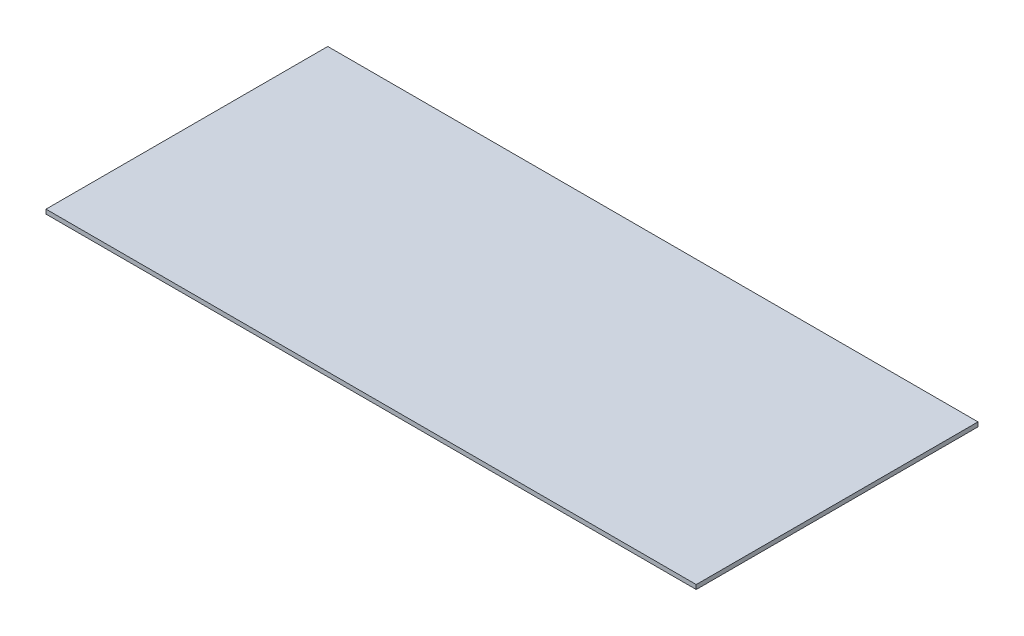
ISO-10303-21;
HEADER;
FILE_DESCRIPTION(('STEP AP214'),'2;1');
FILE_NAME('part.step','',(''),(''),'','','');
FILE_SCHEMA(('AUTOMOTIVE_DESIGN { 1 0 10303 214 1 1 1 1 }'));
ENDSEC;
DATA;
#1=APPLICATION_CONTEXT('core data for automotive mechanical design processes');
#2=APPLICATION_PROTOCOL_DEFINITION('international standard','automotive_design',2000,#1);
#3=PRODUCT_CONTEXT('',#1,'mechanical');
#4=PRODUCT('Part','Part','',(#3));
#5=PRODUCT_RELATED_PRODUCT_CATEGORY('part','',(#4));
#6=PRODUCT_DEFINITION_FORMATION('','',#4);
#7=PRODUCT_DEFINITION_CONTEXT('part definition',#1,'design');
#8=PRODUCT_DEFINITION('design','',#6,#7);
#9=PRODUCT_DEFINITION_SHAPE('','',#8);
#10=(LENGTH_UNIT() NAMED_UNIT(*) SI_UNIT(.MILLI.,.METRE.));
#11=(NAMED_UNIT(*) PLANE_ANGLE_UNIT() SI_UNIT($,.RADIAN.));
#12=(NAMED_UNIT(*) SI_UNIT($,.STERADIAN.) SOLID_ANGLE_UNIT());
#13=UNCERTAINTY_MEASURE_WITH_UNIT(LENGTH_MEASURE(1.E-05),#10,'distance_accuracy_value','');
#14=(GEOMETRIC_REPRESENTATION_CONTEXT(3) GLOBAL_UNCERTAINTY_ASSIGNED_CONTEXT((#13)) GLOBAL_UNIT_ASSIGNED_CONTEXT((#10,
#11,#12)) REPRESENTATION_CONTEXT('',''));
#15=CARTESIAN_POINT('',(0.,0.,0.));
#16=DIRECTION('',(0.,0.,1.));
#17=DIRECTION('',(1.,0.,0.));
#18=AXIS2_PLACEMENT_3D('',#15,#16,#17);
#19=CARTESIAN_POINT('',(190.5,2.54,82.55));
#20=DIRECTION('',(-1.,0.,0.));
#21=DIRECTION('',(0.,0.,1.));
#22=AXIS2_PLACEMENT_3D('',#19,#20,#21);
#23=PLANE('',#22);
#24=DIRECTION('',(0.,0.,-1.));
#25=VECTOR('',#24,1.);
#26=CARTESIAN_POINT('',(190.5,0.,82.55));
#27=LINE('',#26,#25);
#28=CARTESIAN_POINT('',(190.5,0.,82.55));
#29=VERTEX_POINT('',#28);
#30=CARTESIAN_POINT('',(190.5,0.,-82.55));
#31=VERTEX_POINT('',#30);
#32=EDGE_CURVE('E96',#29,#31,#27,.T.);
#33=ORIENTED_EDGE('',*,*,#32,.T.);
#34=DIRECTION('',(0.,-1.,0.));
#35=VECTOR('',#34,1.);
#36=CARTESIAN_POINT('',(190.5,2.54,-82.55));
#37=LINE('',#36,#35);
#38=CARTESIAN_POINT('',(190.5,2.54,-82.55));
#39=VERTEX_POINT('',#38);
#40=EDGE_CURVE('E11',#39,#31,#37,.T.);
#41=ORIENTED_EDGE('',*,*,#40,.F.);
#42=DIRECTION('',(0.,0.,-1.));
#43=VECTOR('',#42,1.);
#44=CARTESIAN_POINT('',(190.5,2.54,82.55));
#45=LINE('',#44,#43);
#46=CARTESIAN_POINT('',(190.5,2.54,82.55));
#47=VERTEX_POINT('',#46);
#48=EDGE_CURVE('E84',#47,#39,#45,.T.);
#49=ORIENTED_EDGE('',*,*,#48,.F.);
#50=DIRECTION('',(0.,-1.,0.));
#51=VECTOR('',#50,1.);
#52=CARTESIAN_POINT('',(190.5,2.54,82.55));
#53=LINE('',#52,#51);
#54=EDGE_CURVE('E92',#47,#29,#53,.T.);
#55=ORIENTED_EDGE('',*,*,#54,.T.);
#56=EDGE_LOOP('',(#33,#41,#49,#55));
#57=FACE_BOUND('',#56,.T.);
#58=ADVANCED_FACE('F33',(#57),#23,.F.);
#59=CARTESIAN_POINT('',(-190.5,2.54,-82.55));
#60=DIRECTION('',(0.,0.,1.));
#61=DIRECTION('',(1.,0.,0.));
#62=AXIS2_PLACEMENT_3D('',#59,#60,#61);
#63=PLANE('',#62);
#64=DIRECTION('',(-1.,0.,0.));
#65=VECTOR('',#64,1.);
#66=CARTESIAN_POINT('',(-190.5,0.,-82.55));
#67=LINE('',#66,#65);
#68=CARTESIAN_POINT('',(-190.5,0.,-82.55));
#69=VERTEX_POINT('',#68);
#70=EDGE_CURVE('E88',#31,#69,#67,.T.);
#71=ORIENTED_EDGE('',*,*,#70,.T.);
#72=DIRECTION('',(0.,-1.,0.));
#73=VECTOR('',#72,1.);
#74=CARTESIAN_POINT('',(-190.5,2.54,-82.55));
#75=LINE('',#74,#73);
#76=CARTESIAN_POINT('',(-190.5,2.54,-82.55));
#77=VERTEX_POINT('',#76);
#78=EDGE_CURVE('E41',#77,#69,#75,.T.);
#79=ORIENTED_EDGE('',*,*,#78,.F.);
#80=DIRECTION('',(-1.,0.,0.));
#81=VECTOR('',#80,1.);
#82=CARTESIAN_POINT('',(-190.5,2.54,-82.55));
#83=LINE('',#82,#81);
#84=EDGE_CURVE('E79',#39,#77,#83,.T.);
#85=ORIENTED_EDGE('',*,*,#84,.F.);
#86=ORIENTED_EDGE('',*,*,#40,.T.);
#87=EDGE_LOOP('',(#71,#79,#85,#86));
#88=FACE_BOUND('',#87,.T.);
#89=ADVANCED_FACE('F87',(#88),#63,.F.);
#90=CARTESIAN_POINT('',(-190.5,2.54,82.55));
#91=DIRECTION('',(1.,0.,0.));
#92=DIRECTION('',(0.,0.,-1.));
#93=AXIS2_PLACEMENT_3D('',#90,#91,#92);
#94=PLANE('',#93);
#95=DIRECTION('',(0.,0.,1.));
#96=VECTOR('',#95,1.);
#97=CARTESIAN_POINT('',(-190.5,0.,82.55));
#98=LINE('',#97,#96);
#99=CARTESIAN_POINT('',(-190.5,0.,82.55));
#100=VERTEX_POINT('',#99);
#101=EDGE_CURVE('E66',#69,#100,#98,.T.);
#102=ORIENTED_EDGE('',*,*,#101,.T.);
#103=DIRECTION('',(0.,-1.,0.));
#104=VECTOR('',#103,1.);
#105=CARTESIAN_POINT('',(-190.5,2.54,82.55));
#106=LINE('',#105,#104);
#107=CARTESIAN_POINT('',(-190.5,2.54,82.55));
#108=VERTEX_POINT('',#107);
#109=EDGE_CURVE('E89',#108,#100,#106,.T.);
#110=ORIENTED_EDGE('',*,*,#109,.F.);
#111=DIRECTION('',(0.,0.,1.));
#112=VECTOR('',#111,1.);
#113=CARTESIAN_POINT('',(-190.5,2.54,82.55));
#114=LINE('',#113,#112);
#115=EDGE_CURVE('E82',#77,#108,#114,.T.);
#116=ORIENTED_EDGE('',*,*,#115,.F.);
#117=ORIENTED_EDGE('',*,*,#78,.T.);
#118=EDGE_LOOP('',(#102,#110,#116,#117));
#119=FACE_BOUND('',#118,.T.);
#120=ADVANCED_FACE('F90',(#119),#94,.F.);
#121=CARTESIAN_POINT('',(-190.5,2.54,82.55));
#122=DIRECTION('',(0.,0.,-1.));
#123=DIRECTION('',(-1.,0.,0.));
#124=AXIS2_PLACEMENT_3D('',#121,#122,#123);
#125=PLANE('',#124);
#126=DIRECTION('',(1.,0.,0.));
#127=VECTOR('',#126,1.);
#128=CARTESIAN_POINT('',(-190.5,0.,82.55));
#129=LINE('',#128,#127);
#130=EDGE_CURVE('E72',#100,#29,#129,.T.);
#131=ORIENTED_EDGE('',*,*,#130,.T.);
#132=ORIENTED_EDGE('',*,*,#54,.F.);
#133=DIRECTION('',(1.,0.,0.));
#134=VECTOR('',#133,1.);
#135=CARTESIAN_POINT('',(-190.5,2.54,82.55));
#136=LINE('',#135,#134);
#137=EDGE_CURVE('E49',#108,#47,#136,.T.);
#138=ORIENTED_EDGE('',*,*,#137,.F.);
#139=ORIENTED_EDGE('',*,*,#109,.T.);
#140=EDGE_LOOP('',(#131,#132,#138,#139));
#141=FACE_BOUND('',#140,.T.);
#142=ADVANCED_FACE('F103',(#141),#125,.F.);
#143=CARTESIAN_POINT('',(0.,2.54,0.));
#144=DIRECTION('',(0.,-1.,0.));
#145=DIRECTION('',(0.,0.,-1.));
#146=AXIS2_PLACEMENT_3D('',#143,#144,#145);
#147=PLANE('',#146);
#148=ORIENTED_EDGE('',*,*,#48,.T.);
#149=ORIENTED_EDGE('',*,*,#84,.T.);
#150=ORIENTED_EDGE('',*,*,#115,.T.);
#151=ORIENTED_EDGE('',*,*,#137,.T.);
#152=EDGE_LOOP('',(#148,#149,#150,#151));
#153=FACE_BOUND('',#152,.T.);
#154=ADVANCED_FACE('F80',(#153),#147,.F.);
#155=CARTESIAN_POINT('',(0.,0.,0.));
#156=DIRECTION('',(0.,-1.,0.));
#157=DIRECTION('',(0.,0.,-1.));
#158=AXIS2_PLACEMENT_3D('',#155,#156,#157);
#159=PLANE('',#158);
#160=ORIENTED_EDGE('',*,*,#32,.F.);
#161=ORIENTED_EDGE('',*,*,#130,.F.);
#162=ORIENTED_EDGE('',*,*,#101,.F.);
#163=ORIENTED_EDGE('',*,*,#70,.F.);
#164=EDGE_LOOP('',(#160,#161,#162,#163));
#165=FACE_BOUND('',#164,.T.);
#166=ADVANCED_FACE('F106',(#165),#159,.T.);
#167=CLOSED_SHELL('',(#58,#89,#120,#142,#154,#166));
#168=MANIFOLD_SOLID_BREP('B2',#167);
#169=ADVANCED_BREP_SHAPE_REPRESENTATION('',(#18,#168),#14);
#170=SHAPE_DEFINITION_REPRESENTATION(#9,#169);
ENDSEC;
END-ISO-10303-21;
